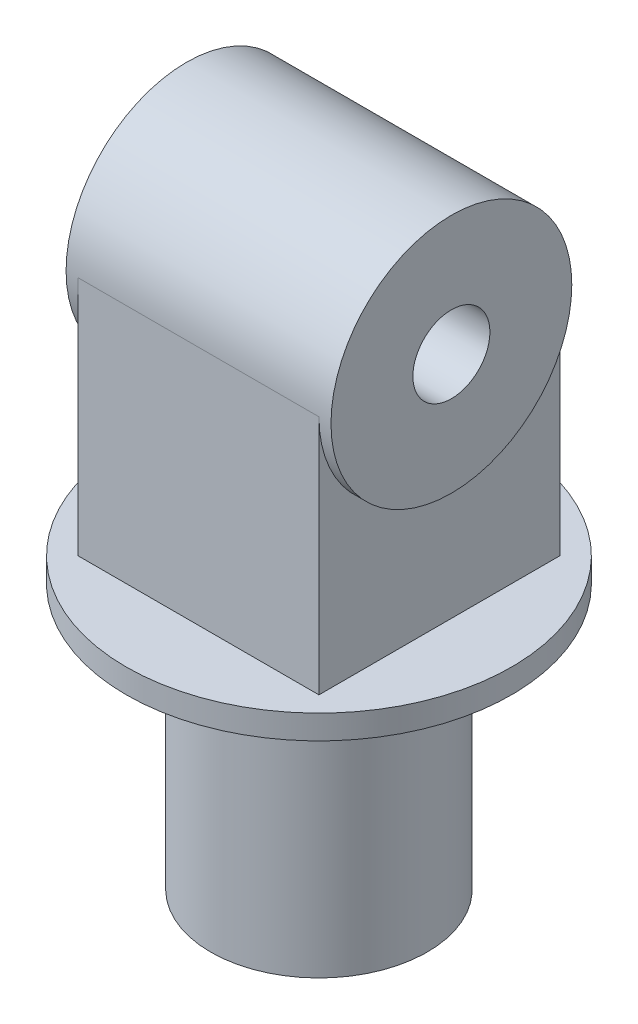
ISO-10303-21;
HEADER;
FILE_DESCRIPTION(('STEP AP214'),'2;1');
FILE_NAME('part.step','',(''),(''),'','','');
FILE_SCHEMA(('AUTOMOTIVE_DESIGN { 1 0 10303 214 1 1 1 1 }'));
ENDSEC;
DATA;
#1=APPLICATION_CONTEXT('core data for automotive mechanical design processes');
#2=APPLICATION_PROTOCOL_DEFINITION('international standard','automotive_design',2000,#1);
#3=PRODUCT_CONTEXT('',#1,'mechanical');
#4=PRODUCT('Part','Part','',(#3));
#5=PRODUCT_RELATED_PRODUCT_CATEGORY('part','',(#4));
#6=PRODUCT_DEFINITION_FORMATION('','',#4);
#7=PRODUCT_DEFINITION_CONTEXT('part definition',#1,'design');
#8=PRODUCT_DEFINITION('design','',#6,#7);
#9=PRODUCT_DEFINITION_SHAPE('','',#8);
#10=(LENGTH_UNIT() NAMED_UNIT(*) SI_UNIT(.MILLI.,.METRE.));
#11=(NAMED_UNIT(*) PLANE_ANGLE_UNIT() SI_UNIT($,.RADIAN.));
#12=(NAMED_UNIT(*) SI_UNIT($,.STERADIAN.) SOLID_ANGLE_UNIT());
#13=UNCERTAINTY_MEASURE_WITH_UNIT(LENGTH_MEASURE(1.E-05),#10,'distance_accuracy_value','');
#14=(GEOMETRIC_REPRESENTATION_CONTEXT(3) GLOBAL_UNCERTAINTY_ASSIGNED_CONTEXT((#13)) GLOBAL_UNIT_ASSIGNED_CONTEXT((#10,
#11,#12)) REPRESENTATION_CONTEXT('',''));
#15=CARTESIAN_POINT('',(0.,0.,0.));
#16=DIRECTION('',(0.,0.,1.));
#17=DIRECTION('',(1.,0.,0.));
#18=AXIS2_PLACEMENT_3D('',#15,#16,#17);
#19=CARTESIAN_POINT('',(0.,55.,0.));
#20=DIRECTION('',(0.,-1.,0.));
#21=DIRECTION('',(0.,0.,-1.));
#22=AXIS2_PLACEMENT_3D('',#19,#20,#21);
#23=CYLINDRICAL_SURFACE('',#22,22.5);
#24=CARTESIAN_POINT('',(0.,55.,0.));
#25=DIRECTION('',(0.,1.,0.));
#26=DIRECTION('',(0.,0.,1.));
#27=AXIS2_PLACEMENT_3D('',#24,#25,#26);
#28=CIRCLE('',#27,22.5);
#29=CARTESIAN_POINT('',(0.,55.,22.5));
#30=VERTEX_POINT('',#29);
#31=EDGE_CURVE('E11',#30,#30,#28,.T.);
#32=ORIENTED_EDGE('',*,*,#31,.F.);
#33=EDGE_LOOP('',(#32));
#34=FACE_BOUND('',#33,.T.);
#35=CARTESIAN_POINT('',(0.,0.,0.));
#36=DIRECTION('',(0.,1.,0.));
#37=DIRECTION('',(0.,0.,1.));
#38=AXIS2_PLACEMENT_3D('',#35,#36,#37);
#39=CIRCLE('',#38,22.5);
#40=CARTESIAN_POINT('',(0.,0.,22.5));
#41=VERTEX_POINT('',#40);
#42=EDGE_CURVE('E41',#41,#41,#39,.T.);
#43=ORIENTED_EDGE('',*,*,#42,.T.);
#44=EDGE_LOOP('',(#43));
#45=FACE_BOUND('',#44,.T.);
#46=ADVANCED_FACE('F38',(#34,#45),#23,.T.);
#47=CARTESIAN_POINT('',(0.,0.,0.));
#48=DIRECTION('',(0.,1.,0.));
#49=DIRECTION('',(0.,0.,1.));
#50=AXIS2_PLACEMENT_3D('',#47,#48,#49);
#51=PLANE('',#50);
#52=ORIENTED_EDGE('',*,*,#42,.F.);
#53=EDGE_LOOP('',(#52));
#54=FACE_BOUND('',#53,.T.);
#55=ADVANCED_FACE('F139',(#54),#51,.F.);
#56=CARTESIAN_POINT('',(0.,60.,0.));
#57=DIRECTION('',(0.,-1.,0.));
#58=DIRECTION('',(0.,0.,-1.));
#59=AXIS2_PLACEMENT_3D('',#56,#57,#58);
#60=CYLINDRICAL_SURFACE('',#59,40.);
#61=CARTESIAN_POINT('',(0.,60.,0.));
#62=DIRECTION('',(0.,1.,0.));
#63=DIRECTION('',(0.,0.,1.));
#64=AXIS2_PLACEMENT_3D('',#61,#62,#63);
#65=CIRCLE('',#64,40.);
#66=CARTESIAN_POINT('',(0.,60.,40.));
#67=VERTEX_POINT('',#66);
#68=EDGE_CURVE('E116',#67,#67,#65,.T.);
#69=ORIENTED_EDGE('',*,*,#68,.F.);
#70=EDGE_LOOP('',(#69));
#71=FACE_BOUND('',#70,.T.);
#72=CARTESIAN_POINT('',(0.,55.,0.));
#73=DIRECTION('',(0.,1.,0.));
#74=DIRECTION('',(0.,0.,1.));
#75=AXIS2_PLACEMENT_3D('',#72,#73,#74);
#76=CIRCLE('',#75,40.);
#77=CARTESIAN_POINT('',(0.,55.,40.));
#78=VERTEX_POINT('',#77);
#79=EDGE_CURVE('E115',#78,#78,#76,.T.);
#80=ORIENTED_EDGE('',*,*,#79,.T.);
#81=EDGE_LOOP('',(#80));
#82=FACE_BOUND('',#81,.T.);
#83=ADVANCED_FACE('F122',(#71,#82),#60,.T.);
#84=CARTESIAN_POINT('',(0.,60.,0.));
#85=DIRECTION('',(0.,1.,0.));
#86=DIRECTION('',(0.,0.,1.));
#87=AXIS2_PLACEMENT_3D('',#84,#85,#86);
#88=PLANE('',#87);
#89=DIRECTION('',(0.,0.,-1.));
#90=VECTOR('',#89,1.);
#91=CARTESIAN_POINT('',(25.,60.,25.));
#92=LINE('',#91,#90);
#93=CARTESIAN_POINT('',(25.,60.,25.));
#94=VERTEX_POINT('',#93);
#95=CARTESIAN_POINT('',(25.,60.,-25.));
#96=VERTEX_POINT('',#95);
#97=EDGE_CURVE('E52',#94,#96,#92,.T.);
#98=ORIENTED_EDGE('',*,*,#97,.F.);
#99=DIRECTION('',(1.,0.,0.));
#100=VECTOR('',#99,1.);
#101=CARTESIAN_POINT('',(-25.,60.,25.));
#102=LINE('',#101,#100);
#103=CARTESIAN_POINT('',(-25.,60.,25.));
#104=VERTEX_POINT('',#103);
#105=EDGE_CURVE('E56',#104,#94,#102,.T.);
#106=ORIENTED_EDGE('',*,*,#105,.F.);
#107=DIRECTION('',(0.,0.,1.));
#108=VECTOR('',#107,1.);
#109=CARTESIAN_POINT('',(-25.,60.,25.));
#110=LINE('',#109,#108);
#111=CARTESIAN_POINT('',(-25.,60.,-25.));
#112=VERTEX_POINT('',#111);
#113=EDGE_CURVE('E104',#112,#104,#110,.T.);
#114=ORIENTED_EDGE('',*,*,#113,.F.);
#115=DIRECTION('',(-1.,0.,0.));
#116=VECTOR('',#115,1.);
#117=CARTESIAN_POINT('',(-25.,60.,-25.));
#118=LINE('',#117,#116);
#119=EDGE_CURVE('E83',#96,#112,#118,.T.);
#120=ORIENTED_EDGE('',*,*,#119,.F.);
#121=EDGE_LOOP('',(#98,#106,#114,#120));
#122=FACE_BOUND('',#121,.T.);
#123=ORIENTED_EDGE('',*,*,#68,.T.);
#124=EDGE_LOOP('',(#123));
#125=FACE_BOUND('',#124,.T.);
#126=ADVANCED_FACE('F127',(#122,#125),#88,.T.);
#127=CARTESIAN_POINT('',(0.,55.,0.));
#128=DIRECTION('',(0.,1.,0.));
#129=DIRECTION('',(0.,0.,1.));
#130=AXIS2_PLACEMENT_3D('',#127,#128,#129);
#131=PLANE('',#130);
#132=ORIENTED_EDGE('',*,*,#31,.T.);
#133=EDGE_LOOP('',(#132));
#134=FACE_BOUND('',#133,.T.);
#135=ORIENTED_EDGE('',*,*,#79,.F.);
#136=EDGE_LOOP('',(#135));
#137=FACE_BOUND('',#136,.T.);
#138=ADVANCED_FACE('F124',(#134,#137),#131,.F.);
#139=CARTESIAN_POINT('',(25.,110.,25.));
#140=DIRECTION('',(-1.,0.,0.));
#141=DIRECTION('',(0.,0.,1.));
#142=AXIS2_PLACEMENT_3D('',#139,#140,#141);
#143=PLANE('',#142);
#144=CARTESIAN_POINT('',(25.,110.,0.));
#145=DIRECTION('',(-1.,0.,0.));
#146=DIRECTION('',(0.,0.,1.));
#147=AXIS2_PLACEMENT_3D('',#144,#145,#146);
#148=CIRCLE('',#147,25.);
#149=CARTESIAN_POINT('',(25.,110.,25.));
#150=VERTEX_POINT('',#149);
#151=CARTESIAN_POINT('',(25.,110.,-25.));
#152=VERTEX_POINT('',#151);
#153=EDGE_CURVE('E95',#150,#152,#148,.F.);
#154=ORIENTED_EDGE('',*,*,#153,.F.);
#155=DIRECTION('',(0.,-1.,0.));
#156=VECTOR('',#155,1.);
#157=CARTESIAN_POINT('',(25.,110.,25.));
#158=LINE('',#157,#156);
#159=EDGE_CURVE('E102',#150,#94,#158,.T.);
#160=ORIENTED_EDGE('',*,*,#159,.T.);
#161=ORIENTED_EDGE('',*,*,#97,.T.);
#162=DIRECTION('',(0.,-1.,0.));
#163=VECTOR('',#162,1.);
#164=CARTESIAN_POINT('',(25.,110.,-25.));
#165=LINE('',#164,#163);
#166=EDGE_CURVE('E85',#152,#96,#165,.T.);
#167=ORIENTED_EDGE('',*,*,#166,.F.);
#168=EDGE_LOOP('',(#154,#160,#161,#167));
#169=FACE_BOUND('',#168,.T.);
#170=ADVANCED_FACE('F126',(#169),#143,.F.);
#171=CARTESIAN_POINT('',(-25.,110.,-25.));
#172=DIRECTION('',(0.,0.,1.));
#173=DIRECTION('',(1.,0.,0.));
#174=AXIS2_PLACEMENT_3D('',#171,#172,#173);
#175=PLANE('',#174);
#176=ORIENTED_EDGE('',*,*,#119,.T.);
#177=DIRECTION('',(0.,-1.,0.));
#178=VECTOR('',#177,1.);
#179=CARTESIAN_POINT('',(-25.,110.,-25.));
#180=LINE('',#179,#178);
#181=CARTESIAN_POINT('',(-25.,110.,-25.));
#182=VERTEX_POINT('',#181);
#183=EDGE_CURVE('E76',#182,#112,#180,.T.);
#184=ORIENTED_EDGE('',*,*,#183,.F.);
#185=DIRECTION('',(-1.,0.,0.));
#186=VECTOR('',#185,1.);
#187=CARTESIAN_POINT('',(-25.,110.,-25.));
#188=LINE('',#187,#186);
#189=EDGE_CURVE('E81',#152,#182,#188,.T.);
#190=ORIENTED_EDGE('',*,*,#189,.F.);
#191=ORIENTED_EDGE('',*,*,#166,.T.);
#192=EDGE_LOOP('',(#176,#184,#190,#191));
#193=FACE_BOUND('',#192,.T.);
#194=ADVANCED_FACE('F78',(#193),#175,.F.);
#195=CARTESIAN_POINT('',(-25.,110.,25.));
#196=DIRECTION('',(1.,0.,0.));
#197=DIRECTION('',(0.,0.,-1.));
#198=AXIS2_PLACEMENT_3D('',#195,#196,#197);
#199=PLANE('',#198);
#200=CARTESIAN_POINT('',(-25.,110.,0.));
#201=DIRECTION('',(1.,0.,0.));
#202=DIRECTION('',(0.,0.,-1.));
#203=AXIS2_PLACEMENT_3D('',#200,#201,#202);
#204=CIRCLE('',#203,25.);
#205=CARTESIAN_POINT('',(-25.,110.,25.));
#206=VERTEX_POINT('',#205);
#207=EDGE_CURVE('E89',#182,#206,#204,.F.);
#208=ORIENTED_EDGE('',*,*,#207,.F.);
#209=ORIENTED_EDGE('',*,*,#183,.T.);
#210=ORIENTED_EDGE('',*,*,#113,.T.);
#211=DIRECTION('',(0.,-1.,0.));
#212=VECTOR('',#211,1.);
#213=CARTESIAN_POINT('',(-25.,110.,25.));
#214=LINE('',#213,#212);
#215=EDGE_CURVE('E86',#206,#104,#214,.T.);
#216=ORIENTED_EDGE('',*,*,#215,.F.);
#217=EDGE_LOOP('',(#208,#209,#210,#216));
#218=FACE_BOUND('',#217,.T.);
#219=ADVANCED_FACE('F90',(#218),#199,.F.);
#220=CARTESIAN_POINT('',(-25.,110.,25.));
#221=DIRECTION('',(0.,0.,-1.));
#222=DIRECTION('',(-1.,0.,0.));
#223=AXIS2_PLACEMENT_3D('',#220,#221,#222);
#224=PLANE('',#223);
#225=ORIENTED_EDGE('',*,*,#105,.T.);
#226=ORIENTED_EDGE('',*,*,#159,.F.);
#227=DIRECTION('',(1.,0.,0.));
#228=VECTOR('',#227,1.);
#229=CARTESIAN_POINT('',(-25.,110.,25.));
#230=LINE('',#229,#228);
#231=EDGE_CURVE('E100',#206,#150,#230,.T.);
#232=ORIENTED_EDGE('',*,*,#231,.F.);
#233=ORIENTED_EDGE('',*,*,#215,.T.);
#234=EDGE_LOOP('',(#225,#226,#232,#233));
#235=FACE_BOUND('',#234,.T.);
#236=ADVANCED_FACE('F186',(#235),#224,.F.);
#237=CARTESIAN_POINT('',(27.5,110.,0.));
#238=DIRECTION('',(-1.,0.,0.));
#239=DIRECTION('',(0.,0.,1.));
#240=AXIS2_PLACEMENT_3D('',#237,#238,#239);
#241=CYLINDRICAL_SURFACE('',#240,25.);
#242=CARTESIAN_POINT('',(27.5,110.,0.));
#243=DIRECTION('',(1.,0.,0.));
#244=DIRECTION('',(0.,0.,-1.));
#245=AXIS2_PLACEMENT_3D('',#242,#243,#244);
#246=CIRCLE('',#245,25.);
#247=CARTESIAN_POINT('',(27.5,110.,-25.));
#248=VERTEX_POINT('',#247);
#249=EDGE_CURVE('E96',#248,#248,#246,.T.);
#250=ORIENTED_EDGE('',*,*,#249,.F.);
#251=EDGE_LOOP('',(#250));
#252=FACE_BOUND('',#251,.T.);
#253=CARTESIAN_POINT('',(-27.5,110.,0.));
#254=DIRECTION('',(1.,0.,0.));
#255=DIRECTION('',(0.,0.,-1.));
#256=AXIS2_PLACEMENT_3D('',#253,#254,#255);
#257=CIRCLE('',#256,25.);
#258=CARTESIAN_POINT('',(-27.5,110.,-25.));
#259=VERTEX_POINT('',#258);
#260=EDGE_CURVE('E249',#259,#259,#257,.T.);
#261=ORIENTED_EDGE('',*,*,#260,.T.);
#262=EDGE_LOOP('',(#261));
#263=FACE_BOUND('',#262,.T.);
#264=ORIENTED_EDGE('',*,*,#231,.T.);
#265=ORIENTED_EDGE('',*,*,#153,.T.);
#266=ORIENTED_EDGE('',*,*,#189,.T.);
#267=ORIENTED_EDGE('',*,*,#207,.T.);
#268=EDGE_LOOP('',(#264,#265,#266,#267));
#269=FACE_BOUND('',#268,.T.);
#270=ADVANCED_FACE('F99',(#252,#263,#269),#241,.T.);
#271=CARTESIAN_POINT('',(27.5,110.,0.));
#272=DIRECTION('',(-1.,0.,0.));
#273=DIRECTION('',(0.,0.,1.));
#274=AXIS2_PLACEMENT_3D('',#271,#272,#273);
#275=CYLINDRICAL_SURFACE('',#274,8.);
#276=CARTESIAN_POINT('',(-27.5,110.,0.));
#277=DIRECTION('',(1.,0.,0.));
#278=DIRECTION('',(0.,0.,-1.));
#279=AXIS2_PLACEMENT_3D('',#276,#277,#278);
#280=CIRCLE('',#279,8.);
#281=CARTESIAN_POINT('',(-27.5,110.,-8.));
#282=VERTEX_POINT('',#281);
#283=EDGE_CURVE('E244',#282,#282,#280,.T.);
#284=ORIENTED_EDGE('',*,*,#283,.F.);
#285=EDGE_LOOP('',(#284));
#286=FACE_BOUND('',#285,.T.);
#287=CARTESIAN_POINT('',(27.5,110.,0.));
#288=DIRECTION('',(1.,0.,0.));
#289=DIRECTION('',(0.,0.,-1.));
#290=AXIS2_PLACEMENT_3D('',#287,#288,#289);
#291=CIRCLE('',#290,8.);
#292=CARTESIAN_POINT('',(27.5,110.,-8.));
#293=VERTEX_POINT('',#292);
#294=EDGE_CURVE('E247',#293,#293,#291,.T.);
#295=ORIENTED_EDGE('',*,*,#294,.T.);
#296=EDGE_LOOP('',(#295));
#297=FACE_BOUND('',#296,.T.);
#298=ADVANCED_FACE('F204',(#286,#297),#275,.F.);
#299=CARTESIAN_POINT('',(27.5,110.,0.));
#300=DIRECTION('',(1.,0.,0.));
#301=DIRECTION('',(0.,0.,-1.));
#302=AXIS2_PLACEMENT_3D('',#299,#300,#301);
#303=PLANE('',#302);
#304=ORIENTED_EDGE('',*,*,#249,.T.);
#305=EDGE_LOOP('',(#304));
#306=FACE_BOUND('',#305,.T.);
#307=ORIENTED_EDGE('',*,*,#294,.F.);
#308=EDGE_LOOP('',(#307));
#309=FACE_BOUND('',#308,.T.);
#310=ADVANCED_FACE('F212',(#306,#309),#303,.T.);
#311=CARTESIAN_POINT('',(-27.5,110.,0.));
#312=DIRECTION('',(1.,0.,0.));
#313=DIRECTION('',(0.,0.,-1.));
#314=AXIS2_PLACEMENT_3D('',#311,#312,#313);
#315=PLANE('',#314);
#316=ORIENTED_EDGE('',*,*,#260,.F.);
#317=EDGE_LOOP('',(#316));
#318=FACE_BOUND('',#317,.T.);
#319=ORIENTED_EDGE('',*,*,#283,.T.);
#320=EDGE_LOOP('',(#319));
#321=FACE_BOUND('',#320,.T.);
#322=ADVANCED_FACE('F217',(#318,#321),#315,.F.);
#323=CLOSED_SHELL('',(#46,#55,#83,#126,#138,#170,#194,#219,#236,#270,#298,#310,#322));
#324=MANIFOLD_SOLID_BREP('B2',#323);
#325=ADVANCED_BREP_SHAPE_REPRESENTATION('',(#18,#324),#14);
#326=SHAPE_DEFINITION_REPRESENTATION(#9,#325);
ENDSEC;
END-ISO-10303-21;
